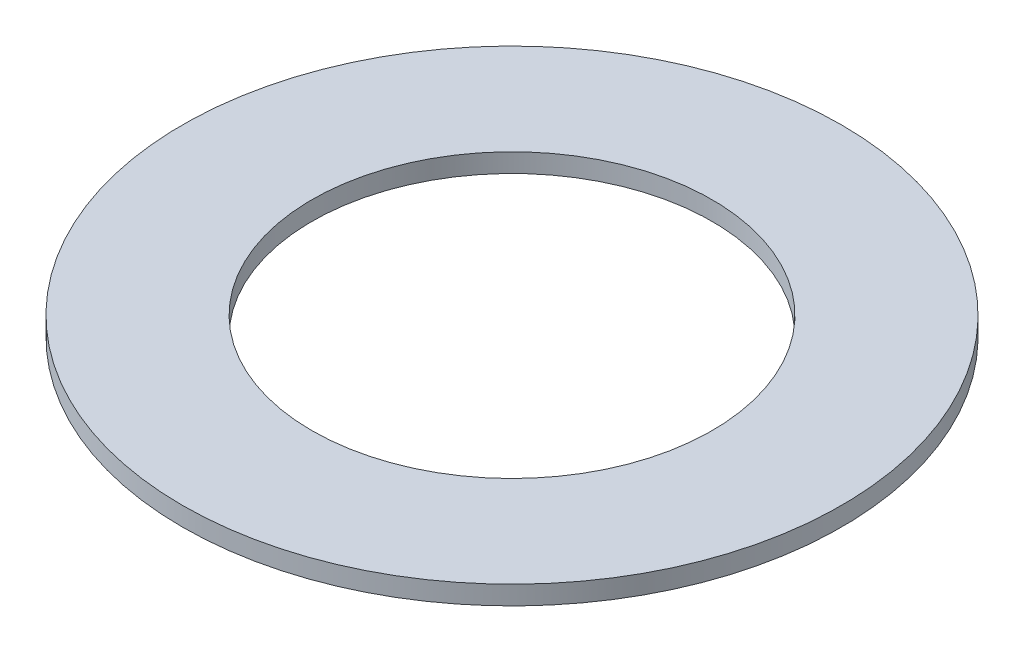
ISO-10303-21;
HEADER;
FILE_DESCRIPTION(('STEP AP214'),'2;1');
FILE_NAME('part.step','',(''),(''),'','','');
FILE_SCHEMA(('AUTOMOTIVE_DESIGN { 1 0 10303 214 1 1 1 1 }'));
ENDSEC;
DATA;
#1=APPLICATION_CONTEXT('core data for automotive mechanical design processes');
#2=APPLICATION_PROTOCOL_DEFINITION('international standard','automotive_design',2000,#1);
#3=PRODUCT_CONTEXT('',#1,'mechanical');
#4=PRODUCT('Part','Part','',(#3));
#5=PRODUCT_RELATED_PRODUCT_CATEGORY('part','',(#4));
#6=PRODUCT_DEFINITION_FORMATION('','',#4);
#7=PRODUCT_DEFINITION_CONTEXT('part definition',#1,'design');
#8=PRODUCT_DEFINITION('design','',#6,#7);
#9=PRODUCT_DEFINITION_SHAPE('','',#8);
#10=(LENGTH_UNIT() NAMED_UNIT(*) SI_UNIT(.MILLI.,.METRE.));
#11=(NAMED_UNIT(*) PLANE_ANGLE_UNIT() SI_UNIT($,.RADIAN.));
#12=(NAMED_UNIT(*) SI_UNIT($,.STERADIAN.) SOLID_ANGLE_UNIT());
#13=UNCERTAINTY_MEASURE_WITH_UNIT(LENGTH_MEASURE(1.E-05),#10,'distance_accuracy_value','');
#14=(GEOMETRIC_REPRESENTATION_CONTEXT(3) GLOBAL_UNCERTAINTY_ASSIGNED_CONTEXT((#13)) GLOBAL_UNIT_ASSIGNED_CONTEXT((#10,
#11,#12)) REPRESENTATION_CONTEXT('',''));
#15=CARTESIAN_POINT('',(0.,0.,0.));
#16=DIRECTION('',(0.,0.,1.));
#17=DIRECTION('',(1.,0.,0.));
#18=AXIS2_PLACEMENT_3D('',#15,#16,#17);
#19=CARTESIAN_POINT('',(0.,4.,0.));
#20=DIRECTION('',(0.,-1.,0.));
#21=DIRECTION('',(0.,0.,-1.));
#22=AXIS2_PLACEMENT_3D('',#19,#20,#21);
#23=CYLINDRICAL_SURFACE('',#22,70.);
#24=CARTESIAN_POINT('',(0.,4.,0.));
#25=DIRECTION('',(0.,1.,0.));
#26=DIRECTION('',(0.,0.,1.));
#27=AXIS2_PLACEMENT_3D('',#24,#25,#26);
#28=CIRCLE('',#27,70.);
#29=CARTESIAN_POINT('',(0.,4.,70.));
#30=VERTEX_POINT('',#29);
#31=EDGE_CURVE('E10',#30,#30,#28,.T.);
#32=ORIENTED_EDGE('',*,*,#31,.F.);
#33=EDGE_LOOP('',(#32));
#34=FACE_BOUND('',#33,.T.);
#35=CARTESIAN_POINT('',(0.,0.,0.));
#36=DIRECTION('',(0.,1.,0.));
#37=DIRECTION('',(0.,0.,1.));
#38=AXIS2_PLACEMENT_3D('',#35,#36,#37);
#39=CIRCLE('',#38,70.);
#40=CARTESIAN_POINT('',(0.,0.,70.));
#41=VERTEX_POINT('',#40);
#42=EDGE_CURVE('E37',#41,#41,#39,.T.);
#43=ORIENTED_EDGE('',*,*,#42,.T.);
#44=EDGE_LOOP('',(#43));
#45=FACE_BOUND('',#44,.T.);
#46=ADVANCED_FACE('F40',(#34,#45),#23,.T.);
#47=CARTESIAN_POINT('',(0.,4.,0.));
#48=DIRECTION('',(0.,1.,0.));
#49=DIRECTION('',(0.,0.,1.));
#50=AXIS2_PLACEMENT_3D('',#47,#48,#49);
#51=PLANE('',#50);
#52=CARTESIAN_POINT('',(0.,4.,0.));
#53=DIRECTION('',(0.,1.,0.));
#54=DIRECTION('',(0.,0.,1.));
#55=AXIS2_PLACEMENT_3D('',#52,#53,#54);
#56=CIRCLE('',#55,42.5);
#57=CARTESIAN_POINT('',(0.,4.,42.5));
#58=VERTEX_POINT('',#57);
#59=EDGE_CURVE('E50',#58,#58,#56,.T.);
#60=ORIENTED_EDGE('',*,*,#59,.F.);
#61=EDGE_LOOP('',(#60));
#62=FACE_BOUND('',#61,.T.);
#63=ORIENTED_EDGE('',*,*,#31,.T.);
#64=EDGE_LOOP('',(#63));
#65=FACE_BOUND('',#64,.T.);
#66=ADVANCED_FACE('F59',(#62,#65),#51,.T.);
#67=CARTESIAN_POINT('',(0.,0.,0.));
#68=DIRECTION('',(0.,1.,0.));
#69=DIRECTION('',(0.,0.,1.));
#70=AXIS2_PLACEMENT_3D('',#67,#68,#69);
#71=PLANE('',#70);
#72=CARTESIAN_POINT('',(0.,0.,0.));
#73=DIRECTION('',(0.,1.,0.));
#74=DIRECTION('',(0.,0.,1.));
#75=AXIS2_PLACEMENT_3D('',#72,#73,#74);
#76=CIRCLE('',#75,42.5);
#77=CARTESIAN_POINT('',(0.,0.,42.5));
#78=VERTEX_POINT('',#77);
#79=EDGE_CURVE('E47',#78,#78,#76,.T.);
#80=ORIENTED_EDGE('',*,*,#79,.T.);
#81=EDGE_LOOP('',(#80));
#82=FACE_BOUND('',#81,.T.);
#83=ORIENTED_EDGE('',*,*,#42,.F.);
#84=EDGE_LOOP('',(#83));
#85=FACE_BOUND('',#84,.T.);
#86=ADVANCED_FACE('F58',(#82,#85),#71,.F.);
#87=CARTESIAN_POINT('',(0.,4.,0.));
#88=DIRECTION('',(0.,-1.,0.));
#89=DIRECTION('',(0.,0.,-1.));
#90=AXIS2_PLACEMENT_3D('',#87,#88,#89);
#91=CYLINDRICAL_SURFACE('',#90,42.5);
#92=ORIENTED_EDGE('',*,*,#59,.T.);
#93=EDGE_LOOP('',(#92));
#94=FACE_BOUND('',#93,.T.);
#95=ORIENTED_EDGE('',*,*,#79,.F.);
#96=EDGE_LOOP('',(#95));
#97=FACE_BOUND('',#96,.T.);
#98=ADVANCED_FACE('F54',(#94,#97),#91,.F.);
#99=CLOSED_SHELL('',(#46,#66,#86,#98));
#100=MANIFOLD_SOLID_BREP('B2',#99);
#101=ADVANCED_BREP_SHAPE_REPRESENTATION('',(#18,#100),#14);
#102=SHAPE_DEFINITION_REPRESENTATION(#9,#101);
ENDSEC;
END-ISO-10303-21;
